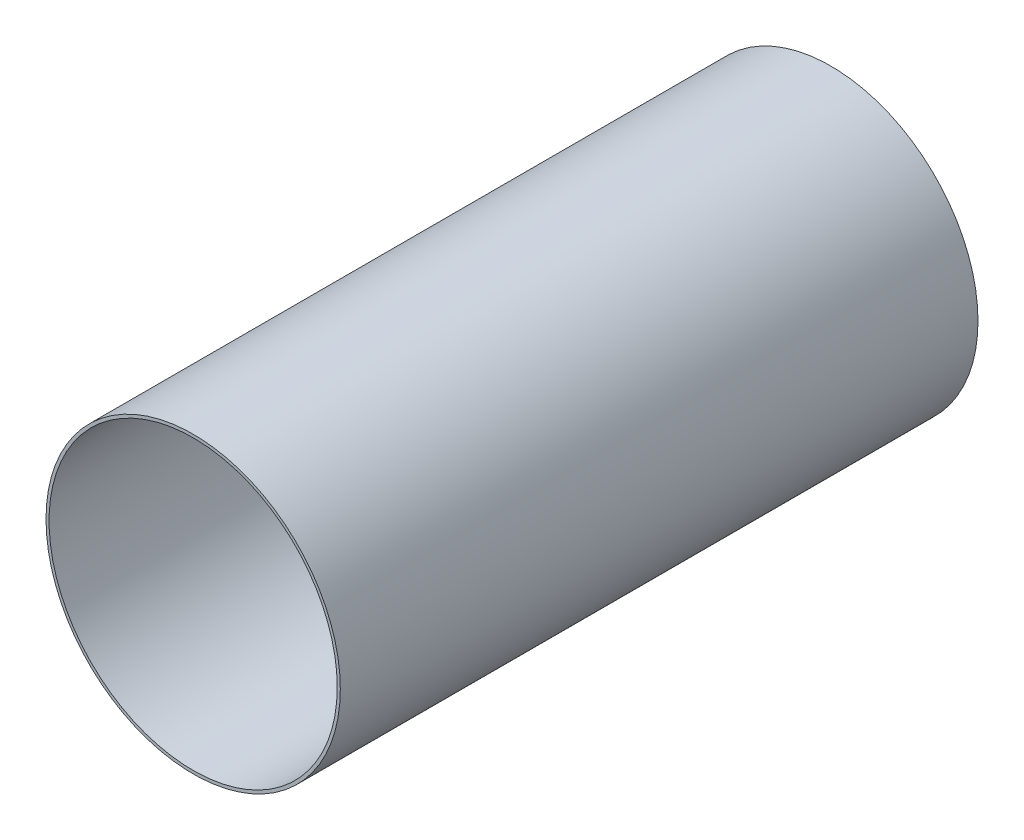
ISO-10303-21;
HEADER;
FILE_DESCRIPTION(('STEP AP214'),'2;1');
FILE_NAME('part.step','',(''),(''),'','','');
FILE_SCHEMA(('AUTOMOTIVE_DESIGN { 1 0 10303 214 1 1 1 1 }'));
ENDSEC;
DATA;
#1=APPLICATION_CONTEXT('core data for automotive mechanical design processes');
#2=APPLICATION_PROTOCOL_DEFINITION('international standard','automotive_design',2000,#1);
#3=PRODUCT_CONTEXT('',#1,'mechanical');
#4=PRODUCT('Part','Part','',(#3));
#5=PRODUCT_RELATED_PRODUCT_CATEGORY('part','',(#4));
#6=PRODUCT_DEFINITION_FORMATION('','',#4);
#7=PRODUCT_DEFINITION_CONTEXT('part definition',#1,'design');
#8=PRODUCT_DEFINITION('design','',#6,#7);
#9=PRODUCT_DEFINITION_SHAPE('','',#8);
#10=(LENGTH_UNIT() NAMED_UNIT(*) SI_UNIT(.MILLI.,.METRE.));
#11=(NAMED_UNIT(*) PLANE_ANGLE_UNIT() SI_UNIT($,.RADIAN.));
#12=(NAMED_UNIT(*) SI_UNIT($,.STERADIAN.) SOLID_ANGLE_UNIT());
#13=UNCERTAINTY_MEASURE_WITH_UNIT(LENGTH_MEASURE(1.E-05),#10,'distance_accuracy_value','');
#14=(GEOMETRIC_REPRESENTATION_CONTEXT(3) GLOBAL_UNCERTAINTY_ASSIGNED_CONTEXT((#13)) GLOBAL_UNIT_ASSIGNED_CONTEXT((#10,
#11,#12)) REPRESENTATION_CONTEXT('',''));
#15=CARTESIAN_POINT('',(0.,0.,0.));
#16=DIRECTION('',(0.,0.,1.));
#17=DIRECTION('',(1.,0.,0.));
#18=AXIS2_PLACEMENT_3D('',#15,#16,#17);
#19=CARTESIAN_POINT('',(0.,0.,660.4));
#20=DIRECTION('',(0.,0.,-1.));
#21=DIRECTION('',(-1.,0.,0.));
#22=AXIS2_PLACEMENT_3D('',#19,#20,#21);
#23=CYLINDRICAL_SURFACE('',#22,152.4);
#24=CARTESIAN_POINT('',(0.,0.,660.4));
#25=DIRECTION('',(0.,0.,1.));
#26=DIRECTION('',(1.,0.,0.));
#27=AXIS2_PLACEMENT_3D('',#24,#25,#26);
#28=CIRCLE('',#27,152.4);
#29=CARTESIAN_POINT('',(152.4,0.,660.4));
#30=VERTEX_POINT('',#29);
#31=EDGE_CURVE('E10',#30,#30,#28,.T.);
#32=ORIENTED_EDGE('',*,*,#31,.F.);
#33=EDGE_LOOP('',(#32));
#34=FACE_BOUND('',#33,.T.);
#35=CARTESIAN_POINT('',(0.,0.,0.));
#36=DIRECTION('',(0.,0.,1.));
#37=DIRECTION('',(1.,0.,0.));
#38=AXIS2_PLACEMENT_3D('',#35,#36,#37);
#39=CIRCLE('',#38,152.4);
#40=CARTESIAN_POINT('',(152.4,0.,0.));
#41=VERTEX_POINT('',#40);
#42=EDGE_CURVE('E42',#41,#41,#39,.T.);
#43=ORIENTED_EDGE('',*,*,#42,.T.);
#44=EDGE_LOOP('',(#43));
#45=FACE_BOUND('',#44,.T.);
#46=ADVANCED_FACE('F39',(#34,#45),#23,.T.);
#47=CARTESIAN_POINT('',(0.,0.,660.4));
#48=DIRECTION('',(0.,0.,1.));
#49=DIRECTION('',(1.,0.,0.));
#50=AXIS2_PLACEMENT_3D('',#47,#48,#49);
#51=PLANE('',#50);
#52=CARTESIAN_POINT('',(0.,0.,660.4));
#53=DIRECTION('',(0.,0.,1.));
#54=DIRECTION('',(1.,0.,0.));
#55=AXIS2_PLACEMENT_3D('',#52,#53,#54);
#56=CIRCLE('',#55,149.225);
#57=CARTESIAN_POINT('',(149.225,0.,660.4));
#58=VERTEX_POINT('',#57);
#59=EDGE_CURVE('E53',#58,#58,#56,.T.);
#60=ORIENTED_EDGE('',*,*,#59,.F.);
#61=EDGE_LOOP('',(#60));
#62=FACE_BOUND('',#61,.T.);
#63=ORIENTED_EDGE('',*,*,#31,.T.);
#64=EDGE_LOOP('',(#63));
#65=FACE_BOUND('',#64,.T.);
#66=ADVANCED_FACE('F70',(#62,#65),#51,.T.);
#67=CARTESIAN_POINT('',(0.,0.,0.));
#68=DIRECTION('',(0.,0.,1.));
#69=DIRECTION('',(1.,0.,0.));
#70=AXIS2_PLACEMENT_3D('',#67,#68,#69);
#71=PLANE('',#70);
#72=CARTESIAN_POINT('',(0.,0.,0.));
#73=DIRECTION('',(0.,0.,1.));
#74=DIRECTION('',(1.,0.,0.));
#75=AXIS2_PLACEMENT_3D('',#72,#73,#74);
#76=CIRCLE('',#75,149.225);
#77=CARTESIAN_POINT('',(149.225,0.,0.));
#78=VERTEX_POINT('',#77);
#79=EDGE_CURVE('E51',#78,#78,#76,.T.);
#80=ORIENTED_EDGE('',*,*,#79,.T.);
#81=EDGE_LOOP('',(#80));
#82=FACE_BOUND('',#81,.T.);
#83=ORIENTED_EDGE('',*,*,#42,.F.);
#84=EDGE_LOOP('',(#83));
#85=FACE_BOUND('',#84,.T.);
#86=ADVANCED_FACE('F61',(#82,#85),#71,.F.);
#87=CARTESIAN_POINT('',(0.,0.,0.));
#88=DIRECTION('',(0.,0.,1.));
#89=DIRECTION('',(1.,0.,0.));
#90=AXIS2_PLACEMENT_3D('',#87,#88,#89);
#91=CYLINDRICAL_SURFACE('',#90,149.225);
#92=ORIENTED_EDGE('',*,*,#79,.F.);
#93=EDGE_LOOP('',(#92));
#94=FACE_BOUND('',#93,.T.);
#95=ORIENTED_EDGE('',*,*,#59,.T.);
#96=EDGE_LOOP('',(#95));
#97=FACE_BOUND('',#96,.T.);
#98=ADVANCED_FACE('F64',(#94,#97),#91,.F.);
#99=CLOSED_SHELL('',(#46,#66,#86,#98));
#100=MANIFOLD_SOLID_BREP('B2',#99);
#101=ADVANCED_BREP_SHAPE_REPRESENTATION('',(#18,#100),#14);
#102=SHAPE_DEFINITION_REPRESENTATION(#9,#101);
ENDSEC;
END-ISO-10303-21;
